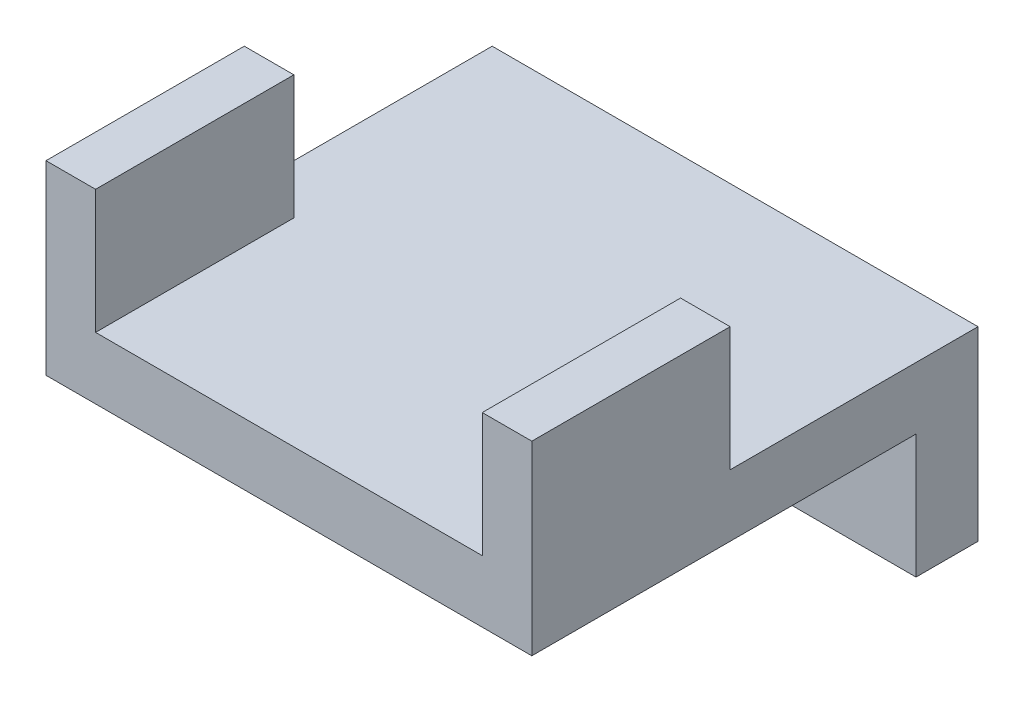
ISO-10303-21;
HEADER;
FILE_DESCRIPTION(('STEP AP214'),'2;1');
FILE_NAME('part.step','',(''),(''),'','','');
FILE_SCHEMA(('AUTOMOTIVE_DESIGN { 1 0 10303 214 1 1 1 1 }'));
ENDSEC;
DATA;
#1=APPLICATION_CONTEXT('core data for automotive mechanical design processes');
#2=APPLICATION_PROTOCOL_DEFINITION('international standard','automotive_design',2000,#1);
#3=PRODUCT_CONTEXT('',#1,'mechanical');
#4=PRODUCT('Part','Part','',(#3));
#5=PRODUCT_RELATED_PRODUCT_CATEGORY('part','',(#4));
#6=PRODUCT_DEFINITION_FORMATION('','',#4);
#7=PRODUCT_DEFINITION_CONTEXT('part definition',#1,'design');
#8=PRODUCT_DEFINITION('design','',#6,#7);
#9=PRODUCT_DEFINITION_SHAPE('','',#8);
#10=(LENGTH_UNIT() NAMED_UNIT(*) SI_UNIT(.MILLI.,.METRE.));
#11=(NAMED_UNIT(*) PLANE_ANGLE_UNIT() SI_UNIT($,.RADIAN.));
#12=(NAMED_UNIT(*) SI_UNIT($,.STERADIAN.) SOLID_ANGLE_UNIT());
#13=UNCERTAINTY_MEASURE_WITH_UNIT(LENGTH_MEASURE(1.E-05),#10,'distance_accuracy_value','');
#14=(GEOMETRIC_REPRESENTATION_CONTEXT(3) GLOBAL_UNCERTAINTY_ASSIGNED_CONTEXT((#13)) GLOBAL_UNIT_ASSIGNED_CONTEXT((#10,
#11,#12)) REPRESENTATION_CONTEXT('',''));
#15=CARTESIAN_POINT('',(0.,0.,0.));
#16=DIRECTION('',(0.,0.,1.));
#17=DIRECTION('',(1.,0.,0.));
#18=AXIS2_PLACEMENT_3D('',#15,#16,#17);
#19=CARTESIAN_POINT('',(0.,3.175,0.));
#20=DIRECTION('',(0.,-1.,0.));
#21=DIRECTION('',(0.,0.,-1.));
#22=AXIS2_PLACEMENT_3D('',#19,#20,#21);
#23=PLANE('',#22);
#24=DIRECTION('',(0.,0.,-1.));
#25=VECTOR('',#24,1.);
#26=CARTESIAN_POINT('',(-9.906,3.175,11.43));
#27=LINE('',#26,#25);
#28=CARTESIAN_POINT('',(-9.906,3.175,11.43));
#29=VERTEX_POINT('',#28);
#30=CARTESIAN_POINT('',(-9.906,3.175,1.27));
#31=VERTEX_POINT('',#30);
#32=EDGE_CURVE('E147',#29,#31,#27,.T.);
#33=ORIENTED_EDGE('',*,*,#32,.F.);
#34=DIRECTION('',(1.,0.,0.));
#35=VECTOR('',#34,1.);
#36=CARTESIAN_POINT('',(-12.446,3.175,11.43));
#37=LINE('',#36,#35);
#38=CARTESIAN_POINT('',(9.906,3.175,11.43));
#39=VERTEX_POINT('',#38);
#40=EDGE_CURVE('E204',#29,#39,#37,.T.);
#41=ORIENTED_EDGE('',*,*,#40,.T.);
#42=DIRECTION('',(0.,0.,1.));
#43=VECTOR('',#42,1.);
#44=CARTESIAN_POINT('',(9.906,3.175,11.43));
#45=LINE('',#44,#43);
#46=CARTESIAN_POINT('',(9.906,3.175,1.27));
#47=VERTEX_POINT('',#46);
#48=EDGE_CURVE('E177',#47,#39,#45,.T.);
#49=ORIENTED_EDGE('',*,*,#48,.F.);
#50=DIRECTION('',(-1.,0.,0.));
#51=VECTOR('',#50,1.);
#52=CARTESIAN_POINT('',(12.446,3.175,1.27));
#53=LINE('',#52,#51);
#54=CARTESIAN_POINT('',(12.446,3.175,1.27));
#55=VERTEX_POINT('',#54);
#56=EDGE_CURVE('E172',#55,#47,#53,.T.);
#57=ORIENTED_EDGE('',*,*,#56,.F.);
#58=DIRECTION('',(0.,0.,-1.));
#59=VECTOR('',#58,1.);
#60=CARTESIAN_POINT('',(12.446,3.175,11.43));
#61=LINE('',#60,#59);
#62=CARTESIAN_POINT('',(12.446,3.175,-11.43));
#63=VERTEX_POINT('',#62);
#64=EDGE_CURVE('E197',#55,#63,#61,.T.);
#65=ORIENTED_EDGE('',*,*,#64,.T.);
#66=DIRECTION('',(-1.,0.,0.));
#67=VECTOR('',#66,1.);
#68=CARTESIAN_POINT('',(-12.446,3.175,-11.43));
#69=LINE('',#68,#67);
#70=CARTESIAN_POINT('',(-12.446,3.175,-11.43));
#71=VERTEX_POINT('',#70);
#72=EDGE_CURVE('E199',#63,#71,#69,.T.);
#73=ORIENTED_EDGE('',*,*,#72,.T.);
#74=DIRECTION('',(0.,0.,1.));
#75=VECTOR('',#74,1.);
#76=CARTESIAN_POINT('',(-12.446,3.175,11.43));
#77=LINE('',#76,#75);
#78=CARTESIAN_POINT('',(-12.446,3.175,1.27));
#79=VERTEX_POINT('',#78);
#80=EDGE_CURVE('E202',#71,#79,#77,.T.);
#81=ORIENTED_EDGE('',*,*,#80,.T.);
#82=DIRECTION('',(-1.,0.,0.));
#83=VECTOR('',#82,1.);
#84=CARTESIAN_POINT('',(-12.446,3.175,1.27));
#85=LINE('',#84,#83);
#86=EDGE_CURVE('E57',#31,#79,#85,.T.);
#87=ORIENTED_EDGE('',*,*,#86,.F.);
#88=EDGE_LOOP('',(#33,#41,#49,#57,#65,#73,#81,#87));
#89=FACE_BOUND('',#88,.T.);
#90=ADVANCED_FACE('F34',(#89),#23,.F.);
#91=CARTESIAN_POINT('',(12.446,3.175,11.43));
#92=DIRECTION('',(-1.,0.,0.));
#93=DIRECTION('',(0.,0.,1.));
#94=AXIS2_PLACEMENT_3D('',#91,#92,#93);
#95=PLANE('',#94);
#96=DIRECTION('',(0.,0.,-1.));
#97=VECTOR('',#96,1.);
#98=CARTESIAN_POINT('',(12.446,0.,11.43));
#99=LINE('',#98,#97);
#100=CARTESIAN_POINT('',(12.446,0.,11.43));
#101=VERTEX_POINT('',#100);
#102=CARTESIAN_POINT('',(12.446,0.,-8.255));
#103=VERTEX_POINT('',#102);
#104=EDGE_CURVE('E146',#101,#103,#99,.T.);
#105=ORIENTED_EDGE('',*,*,#104,.T.);
#106=DIRECTION('',(0.,1.,0.));
#107=VECTOR('',#106,1.);
#108=CARTESIAN_POINT('',(12.446,-6.35,-8.255));
#109=LINE('',#108,#107);
#110=CARTESIAN_POINT('',(12.446,-6.35,-8.255));
#111=VERTEX_POINT('',#110);
#112=EDGE_CURVE('E128',#111,#103,#109,.T.);
#113=ORIENTED_EDGE('',*,*,#112,.F.);
#114=DIRECTION('',(0.,0.,1.));
#115=VECTOR('',#114,1.);
#116=CARTESIAN_POINT('',(12.446,-6.35,-11.43));
#117=LINE('',#116,#115);
#118=CARTESIAN_POINT('',(12.446,-6.35,-11.43));
#119=VERTEX_POINT('',#118);
#120=EDGE_CURVE('E135',#119,#111,#117,.T.);
#121=ORIENTED_EDGE('',*,*,#120,.F.);
#122=DIRECTION('',(0.,-1.,0.));
#123=VECTOR('',#122,1.);
#124=CARTESIAN_POINT('',(12.446,3.175,-11.43));
#125=LINE('',#124,#123);
#126=EDGE_CURVE('E11',#63,#119,#125,.T.);
#127=ORIENTED_EDGE('',*,*,#126,.F.);
#128=ORIENTED_EDGE('',*,*,#64,.F.);
#129=DIRECTION('',(0.,-1.,0.));
#130=VECTOR('',#129,1.);
#131=CARTESIAN_POINT('',(12.446,9.525,1.27));
#132=LINE('',#131,#130);
#133=CARTESIAN_POINT('',(12.446,9.525,1.27));
#134=VERTEX_POINT('',#133);
#135=EDGE_CURVE('E194',#134,#55,#132,.T.);
#136=ORIENTED_EDGE('',*,*,#135,.F.);
#137=DIRECTION('',(0.,0.,-1.));
#138=VECTOR('',#137,1.);
#139=CARTESIAN_POINT('',(12.446,9.525,11.43));
#140=LINE('',#139,#138);
#141=CARTESIAN_POINT('',(12.446,9.525,11.43));
#142=VERTEX_POINT('',#141);
#143=EDGE_CURVE('E173',#142,#134,#140,.T.);
#144=ORIENTED_EDGE('',*,*,#143,.F.);
#145=DIRECTION('',(0.,-1.,0.));
#146=VECTOR('',#145,1.);
#147=CARTESIAN_POINT('',(12.446,3.175,11.43));
#148=LINE('',#147,#146);
#149=EDGE_CURVE('E206',#142,#101,#148,.T.);
#150=ORIENTED_EDGE('',*,*,#149,.T.);
#151=EDGE_LOOP('',(#105,#113,#121,#127,#128,#136,#144,#150));
#152=FACE_BOUND('',#151,.T.);
#153=ADVANCED_FACE('F36',(#152),#95,.F.);
#154=CARTESIAN_POINT('',(-12.446,3.175,-11.43));
#155=DIRECTION('',(0.,0.,1.));
#156=DIRECTION('',(1.,0.,0.));
#157=AXIS2_PLACEMENT_3D('',#154,#155,#156);
#158=PLANE('',#157);
#159=ORIENTED_EDGE('',*,*,#126,.T.);
#160=DIRECTION('',(1.,0.,0.));
#161=VECTOR('',#160,1.);
#162=CARTESIAN_POINT('',(12.446,-6.35,-11.43));
#163=LINE('',#162,#161);
#164=CARTESIAN_POINT('',(-12.446,-6.35,-11.43));
#165=VERTEX_POINT('',#164);
#166=EDGE_CURVE('E141',#165,#119,#163,.T.);
#167=ORIENTED_EDGE('',*,*,#166,.F.);
#168=DIRECTION('',(0.,-1.,0.));
#169=VECTOR('',#168,1.);
#170=CARTESIAN_POINT('',(-12.446,3.175,-11.43));
#171=LINE('',#170,#169);
#172=EDGE_CURVE('E42',#71,#165,#171,.T.);
#173=ORIENTED_EDGE('',*,*,#172,.F.);
#174=ORIENTED_EDGE('',*,*,#72,.F.);
#175=EDGE_LOOP('',(#159,#167,#173,#174));
#176=FACE_BOUND('',#175,.T.);
#177=ADVANCED_FACE('F221',(#176),#158,.F.);
#178=CARTESIAN_POINT('',(-12.446,3.175,11.43));
#179=DIRECTION('',(1.,0.,0.));
#180=DIRECTION('',(0.,0.,-1.));
#181=AXIS2_PLACEMENT_3D('',#178,#179,#180);
#182=PLANE('',#181);
#183=ORIENTED_EDGE('',*,*,#172,.T.);
#184=DIRECTION('',(0.,0.,-1.));
#185=VECTOR('',#184,1.);
#186=CARTESIAN_POINT('',(-12.446,-6.35,-11.43));
#187=LINE('',#186,#185);
#188=CARTESIAN_POINT('',(-12.446,-6.35,-8.25500000000001));
#189=VERTEX_POINT('',#188);
#190=EDGE_CURVE('E134',#189,#165,#187,.T.);
#191=ORIENTED_EDGE('',*,*,#190,.F.);
#192=DIRECTION('',(0.,1.,0.));
#193=VECTOR('',#192,1.);
#194=CARTESIAN_POINT('',(-12.446,-6.35,-8.25500000000001));
#195=LINE('',#194,#193);
#196=CARTESIAN_POINT('',(-12.446,0.,-8.25500000000001));
#197=VERTEX_POINT('',#196);
#198=EDGE_CURVE('E130',#189,#197,#195,.T.);
#199=ORIENTED_EDGE('',*,*,#198,.T.);
#200=DIRECTION('',(0.,0.,1.));
#201=VECTOR('',#200,1.);
#202=CARTESIAN_POINT('',(-12.446,0.,11.43));
#203=LINE('',#202,#201);
#204=CARTESIAN_POINT('',(-12.446,0.,11.43));
#205=VERTEX_POINT('',#204);
#206=EDGE_CURVE('E208',#197,#205,#203,.T.);
#207=ORIENTED_EDGE('',*,*,#206,.T.);
#208=DIRECTION('',(0.,-1.,0.));
#209=VECTOR('',#208,1.);
#210=CARTESIAN_POINT('',(-12.446,3.175,11.43));
#211=LINE('',#210,#209);
#212=CARTESIAN_POINT('',(-12.446,9.525,11.43));
#213=VERTEX_POINT('',#212);
#214=EDGE_CURVE('E212',#213,#205,#211,.T.);
#215=ORIENTED_EDGE('',*,*,#214,.F.);
#216=DIRECTION('',(0.,0.,1.));
#217=VECTOR('',#216,1.);
#218=CARTESIAN_POINT('',(-12.446,9.525,11.43));
#219=LINE('',#218,#217);
#220=CARTESIAN_POINT('',(-12.446,9.525,1.27));
#221=VERTEX_POINT('',#220);
#222=EDGE_CURVE('E153',#221,#213,#219,.T.);
#223=ORIENTED_EDGE('',*,*,#222,.F.);
#224=DIRECTION('',(0.,-1.,0.));
#225=VECTOR('',#224,1.);
#226=CARTESIAN_POINT('',(-12.446,9.525,1.27));
#227=LINE('',#226,#225);
#228=EDGE_CURVE('E161',#221,#79,#227,.T.);
#229=ORIENTED_EDGE('',*,*,#228,.T.);
#230=ORIENTED_EDGE('',*,*,#80,.F.);
#231=EDGE_LOOP('',(#183,#191,#199,#207,#215,#223,#229,#230));
#232=FACE_BOUND('',#231,.T.);
#233=ADVANCED_FACE('F217',(#232),#182,.F.);
#234=CARTESIAN_POINT('',(-12.446,3.175,11.43));
#235=DIRECTION('',(0.,0.,-1.));
#236=DIRECTION('',(-1.,0.,0.));
#237=AXIS2_PLACEMENT_3D('',#234,#235,#236);
#238=PLANE('',#237);
#239=DIRECTION('',(1.,0.,0.));
#240=VECTOR('',#239,1.);
#241=CARTESIAN_POINT('',(-12.446,0.,11.43));
#242=LINE('',#241,#240);
#243=EDGE_CURVE('E200',#205,#101,#242,.T.);
#244=ORIENTED_EDGE('',*,*,#243,.T.);
#245=ORIENTED_EDGE('',*,*,#149,.F.);
#246=DIRECTION('',(1.,0.,0.));
#247=VECTOR('',#246,1.);
#248=CARTESIAN_POINT('',(12.446,9.525,11.43));
#249=LINE('',#248,#247);
#250=CARTESIAN_POINT('',(9.906,9.525,11.43));
#251=VERTEX_POINT('',#250);
#252=EDGE_CURVE('E181',#251,#142,#249,.T.);
#253=ORIENTED_EDGE('',*,*,#252,.F.);
#254=DIRECTION('',(0.,-1.,0.));
#255=VECTOR('',#254,1.);
#256=CARTESIAN_POINT('',(9.906,9.525,11.43));
#257=LINE('',#256,#255);
#258=EDGE_CURVE('E184',#251,#39,#257,.T.);
#259=ORIENTED_EDGE('',*,*,#258,.T.);
#260=ORIENTED_EDGE('',*,*,#40,.F.);
#261=DIRECTION('',(0.,-1.,0.));
#262=VECTOR('',#261,1.);
#263=CARTESIAN_POINT('',(-9.906,9.525,11.43));
#264=LINE('',#263,#262);
#265=CARTESIAN_POINT('',(-9.906,9.525,11.43));
#266=VERTEX_POINT('',#265);
#267=EDGE_CURVE('E169',#266,#29,#264,.T.);
#268=ORIENTED_EDGE('',*,*,#267,.F.);
#269=DIRECTION('',(1.,0.,0.));
#270=VECTOR('',#269,1.);
#271=CARTESIAN_POINT('',(-12.446,9.525,11.43));
#272=LINE('',#271,#270);
#273=EDGE_CURVE('E156',#213,#266,#272,.T.);
#274=ORIENTED_EDGE('',*,*,#273,.F.);
#275=ORIENTED_EDGE('',*,*,#214,.T.);
#276=EDGE_LOOP('',(#244,#245,#253,#259,#260,#268,#274,#275));
#277=FACE_BOUND('',#276,.T.);
#278=ADVANCED_FACE('F227',(#277),#238,.F.);
#279=CARTESIAN_POINT('',(0.,0.,0.));
#280=DIRECTION('',(0.,-1.,0.));
#281=DIRECTION('',(0.,0.,-1.));
#282=AXIS2_PLACEMENT_3D('',#279,#280,#281);
#283=PLANE('',#282);
#284=DIRECTION('',(-1.,0.,0.));
#285=VECTOR('',#284,1.);
#286=CARTESIAN_POINT('',(12.446,0.,-8.255));
#287=LINE('',#286,#285);
#288=EDGE_CURVE('E49',#103,#197,#287,.T.);
#289=ORIENTED_EDGE('',*,*,#288,.F.);
#290=ORIENTED_EDGE('',*,*,#104,.F.);
#291=ORIENTED_EDGE('',*,*,#243,.F.);
#292=ORIENTED_EDGE('',*,*,#206,.F.);
#293=EDGE_LOOP('',(#289,#290,#291,#292));
#294=FACE_BOUND('',#293,.T.);
#295=ADVANCED_FACE('F229',(#294),#283,.T.);
#296=CARTESIAN_POINT('',(12.446,9.525,1.27));
#297=DIRECTION('',(0.,0.,1.));
#298=DIRECTION('',(1.,0.,0.));
#299=AXIS2_PLACEMENT_3D('',#296,#297,#298);
#300=PLANE('',#299);
#301=ORIENTED_EDGE('',*,*,#56,.T.);
#302=DIRECTION('',(0.,-1.,0.));
#303=VECTOR('',#302,1.);
#304=CARTESIAN_POINT('',(9.906,9.525,1.27));
#305=LINE('',#304,#303);
#306=CARTESIAN_POINT('',(9.906,9.525,1.27));
#307=VERTEX_POINT('',#306);
#308=EDGE_CURVE('E191',#307,#47,#305,.T.);
#309=ORIENTED_EDGE('',*,*,#308,.F.);
#310=DIRECTION('',(-1.,0.,0.));
#311=VECTOR('',#310,1.);
#312=CARTESIAN_POINT('',(12.446,9.525,1.27));
#313=LINE('',#312,#311);
#314=EDGE_CURVE('E176',#134,#307,#313,.T.);
#315=ORIENTED_EDGE('',*,*,#314,.F.);
#316=ORIENTED_EDGE('',*,*,#135,.T.);
#317=EDGE_LOOP('',(#301,#309,#315,#316));
#318=FACE_BOUND('',#317,.T.);
#319=ADVANCED_FACE('F231',(#318),#300,.F.);
#320=CARTESIAN_POINT('',(9.906,9.525,11.43));
#321=DIRECTION('',(1.,0.,0.));
#322=DIRECTION('',(0.,0.,-1.));
#323=AXIS2_PLACEMENT_3D('',#320,#321,#322);
#324=PLANE('',#323);
#325=ORIENTED_EDGE('',*,*,#48,.T.);
#326=ORIENTED_EDGE('',*,*,#258,.F.);
#327=DIRECTION('',(0.,0.,1.));
#328=VECTOR('',#327,1.);
#329=CARTESIAN_POINT('',(9.906,9.525,11.43));
#330=LINE('',#329,#328);
#331=EDGE_CURVE('E179',#307,#251,#330,.T.);
#332=ORIENTED_EDGE('',*,*,#331,.F.);
#333=ORIENTED_EDGE('',*,*,#308,.T.);
#334=EDGE_LOOP('',(#325,#326,#332,#333));
#335=FACE_BOUND('',#334,.T.);
#336=ADVANCED_FACE('F237',(#335),#324,.F.);
#337=CARTESIAN_POINT('',(0.,9.525,0.));
#338=DIRECTION('',(0.,1.,0.));
#339=DIRECTION('',(0.,0.,1.));
#340=AXIS2_PLACEMENT_3D('',#337,#338,#339);
#341=PLANE('',#340);
#342=ORIENTED_EDGE('',*,*,#143,.T.);
#343=ORIENTED_EDGE('',*,*,#314,.T.);
#344=ORIENTED_EDGE('',*,*,#331,.T.);
#345=ORIENTED_EDGE('',*,*,#252,.T.);
#346=EDGE_LOOP('',(#342,#343,#344,#345));
#347=FACE_BOUND('',#346,.T.);
#348=ADVANCED_FACE('F249',(#347),#341,.T.);
#349=CARTESIAN_POINT('',(-9.906,9.525,11.43));
#350=DIRECTION('',(-1.,0.,0.));
#351=DIRECTION('',(0.,0.,1.));
#352=AXIS2_PLACEMENT_3D('',#349,#350,#351);
#353=PLANE('',#352);
#354=ORIENTED_EDGE('',*,*,#32,.T.);
#355=DIRECTION('',(0.,-1.,0.));
#356=VECTOR('',#355,1.);
#357=CARTESIAN_POINT('',(-9.906,9.525,1.27));
#358=LINE('',#357,#356);
#359=CARTESIAN_POINT('',(-9.906,9.525,1.27));
#360=VERTEX_POINT('',#359);
#361=EDGE_CURVE('E166',#360,#31,#358,.T.);
#362=ORIENTED_EDGE('',*,*,#361,.F.);
#363=DIRECTION('',(0.,0.,-1.));
#364=VECTOR('',#363,1.);
#365=CARTESIAN_POINT('',(-9.906,9.525,11.43));
#366=LINE('',#365,#364);
#367=EDGE_CURVE('E158',#266,#360,#366,.T.);
#368=ORIENTED_EDGE('',*,*,#367,.F.);
#369=ORIENTED_EDGE('',*,*,#267,.T.);
#370=EDGE_LOOP('',(#354,#362,#368,#369));
#371=FACE_BOUND('',#370,.T.);
#372=ADVANCED_FACE('F253',(#371),#353,.F.);
#373=CARTESIAN_POINT('',(-12.446,9.525,1.27));
#374=DIRECTION('',(0.,0.,1.));
#375=DIRECTION('',(1.,0.,0.));
#376=AXIS2_PLACEMENT_3D('',#373,#374,#375);
#377=PLANE('',#376);
#378=ORIENTED_EDGE('',*,*,#86,.T.);
#379=ORIENTED_EDGE('',*,*,#228,.F.);
#380=DIRECTION('',(-1.,0.,0.));
#381=VECTOR('',#380,1.);
#382=CARTESIAN_POINT('',(-12.446,9.525,1.27));
#383=LINE('',#382,#381);
#384=EDGE_CURVE('E160',#360,#221,#383,.T.);
#385=ORIENTED_EDGE('',*,*,#384,.F.);
#386=ORIENTED_EDGE('',*,*,#361,.T.);
#387=EDGE_LOOP('',(#378,#379,#385,#386));
#388=FACE_BOUND('',#387,.T.);
#389=ADVANCED_FACE('F257',(#388),#377,.F.);
#390=CARTESIAN_POINT('',(0.,9.525,0.));
#391=DIRECTION('',(0.,-1.,0.));
#392=DIRECTION('',(0.,0.,-1.));
#393=AXIS2_PLACEMENT_3D('',#390,#391,#392);
#394=PLANE('',#393);
#395=ORIENTED_EDGE('',*,*,#222,.T.);
#396=ORIENTED_EDGE('',*,*,#273,.T.);
#397=ORIENTED_EDGE('',*,*,#367,.T.);
#398=ORIENTED_EDGE('',*,*,#384,.T.);
#399=EDGE_LOOP('',(#395,#396,#397,#398));
#400=FACE_BOUND('',#399,.T.);
#401=ADVANCED_FACE('F261',(#400),#394,.F.);
#402=CARTESIAN_POINT('',(12.446,-6.35,-8.255));
#403=DIRECTION('',(0.,0.,-1.));
#404=DIRECTION('',(-1.,0.,0.));
#405=AXIS2_PLACEMENT_3D('',#402,#403,#404);
#406=PLANE('',#405);
#407=ORIENTED_EDGE('',*,*,#288,.T.);
#408=ORIENTED_EDGE('',*,*,#198,.F.);
#409=DIRECTION('',(-1.,0.,0.));
#410=VECTOR('',#409,1.);
#411=CARTESIAN_POINT('',(12.446,-6.35,-8.255));
#412=LINE('',#411,#410);
#413=EDGE_CURVE('E124',#111,#189,#412,.T.);
#414=ORIENTED_EDGE('',*,*,#413,.F.);
#415=ORIENTED_EDGE('',*,*,#112,.T.);
#416=EDGE_LOOP('',(#407,#408,#414,#415));
#417=FACE_BOUND('',#416,.T.);
#418=ADVANCED_FACE('F126',(#417),#406,.F.);
#419=CARTESIAN_POINT('',(0.,-6.35,0.));
#420=DIRECTION('',(0.,-1.,0.));
#421=DIRECTION('',(0.,0.,-1.));
#422=AXIS2_PLACEMENT_3D('',#419,#420,#421);
#423=PLANE('',#422);
#424=ORIENTED_EDGE('',*,*,#120,.T.);
#425=ORIENTED_EDGE('',*,*,#413,.T.);
#426=ORIENTED_EDGE('',*,*,#190,.T.);
#427=ORIENTED_EDGE('',*,*,#166,.T.);
#428=EDGE_LOOP('',(#424,#425,#426,#427));
#429=FACE_BOUND('',#428,.T.);
#430=ADVANCED_FACE('F139',(#429),#423,.T.);
#431=CLOSED_SHELL('',(#90,#153,#177,#233,#278,#295,#319,#336,#348,#372,#389,#401,#418,#430));
#432=MANIFOLD_SOLID_BREP('B2',#431);
#433=ADVANCED_BREP_SHAPE_REPRESENTATION('',(#18,#432),#14);
#434=SHAPE_DEFINITION_REPRESENTATION(#9,#433);
ENDSEC;
END-ISO-10303-21;
